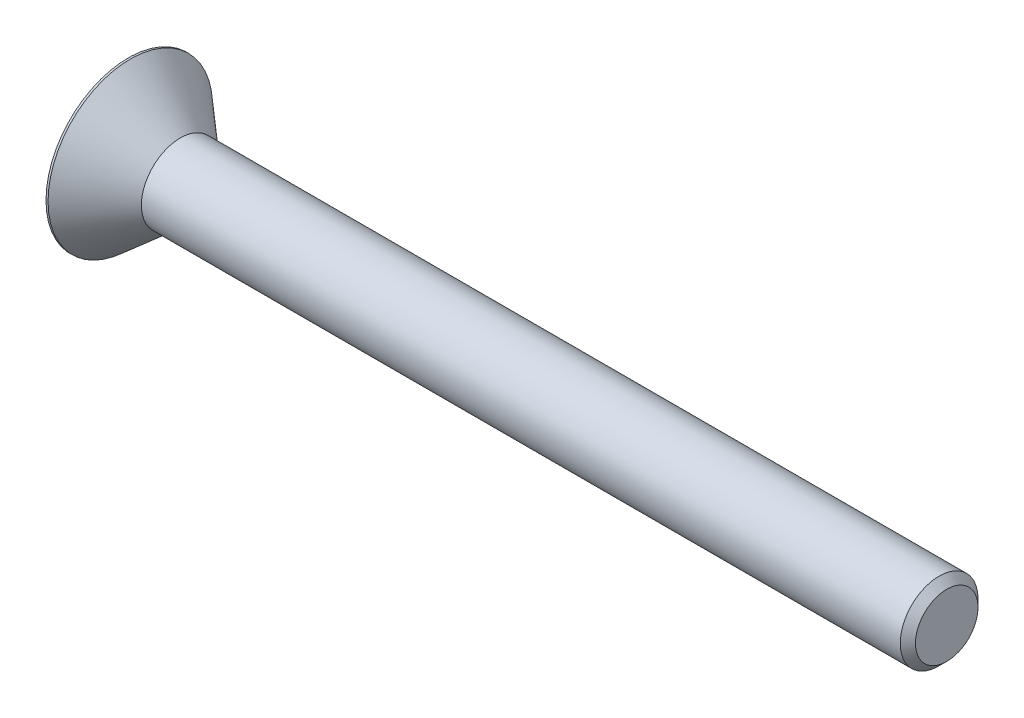
ISO-10303-21;
HEADER;
FILE_DESCRIPTION(('STEP AP214'),'2;1');
FILE_NAME('part.step','',(''),(''),'','','');
FILE_SCHEMA(('AUTOMOTIVE_DESIGN { 1 0 10303 214 1 1 1 1 }'));
ENDSEC;
DATA;
#1=APPLICATION_CONTEXT('core data for automotive mechanical design processes');
#2=APPLICATION_PROTOCOL_DEFINITION('international standard','automotive_design',2000,#1);
#3=PRODUCT_CONTEXT('',#1,'mechanical');
#4=PRODUCT('Part','Part','',(#3));
#5=PRODUCT_RELATED_PRODUCT_CATEGORY('part','',(#4));
#6=PRODUCT_DEFINITION_FORMATION('','',#4);
#7=PRODUCT_DEFINITION_CONTEXT('part definition',#1,'design');
#8=PRODUCT_DEFINITION('design','',#6,#7);
#9=PRODUCT_DEFINITION_SHAPE('','',#8);
#10=(LENGTH_UNIT() NAMED_UNIT(*) SI_UNIT(.MILLI.,.METRE.));
#11=(NAMED_UNIT(*) PLANE_ANGLE_UNIT() SI_UNIT($,.RADIAN.));
#12=(NAMED_UNIT(*) SI_UNIT($,.STERADIAN.) SOLID_ANGLE_UNIT());
#13=UNCERTAINTY_MEASURE_WITH_UNIT(LENGTH_MEASURE(1.E-05),#10,'distance_accuracy_value','');
#14=(GEOMETRIC_REPRESENTATION_CONTEXT(3) GLOBAL_UNCERTAINTY_ASSIGNED_CONTEXT((#13)) GLOBAL_UNIT_ASSIGNED_CONTEXT((#10,
#11,#12)) REPRESENTATION_CONTEXT('',''));
#15=CARTESIAN_POINT('',(0.,0.,0.));
#16=DIRECTION('',(0.,0.,1.));
#17=DIRECTION('',(1.,0.,0.));
#18=AXIS2_PLACEMENT_3D('',#15,#16,#17);
#19=CARTESIAN_POINT('',(2.20980000000282,0.,0.));
#20=DIRECTION('',(-1.,0.,0.));
#21=DIRECTION('',(0.,0.,1.));
#22=AXIS2_PLACEMENT_3D('',#19,#20,#21);
#23=CONICAL_SURFACE('',#22,1.58750000002783,1.04719755117658);
#24=CARTESIAN_POINT('',(3.12634355233854,0.,-5.6843418860808E-11));
#25=VERTEX_POINT('',#24);
#26=VERTEX_LOOP('',#25);
#27=FACE_BOUND('',#26,.T.);
#28=CARTESIAN_POINT('',(2.20980000000282,0.,0.));
#29=DIRECTION('',(-1.,0.,0.));
#30=DIRECTION('',(0.,0.,1.));
#31=AXIS2_PLACEMENT_3D('',#28,#29,#30);
#32=CIRCLE('',#31,1.58750000002783);
#33=CARTESIAN_POINT('',(2.20980000000141,0.,-1.58750000001392));
#34=VERTEX_POINT('',#33);
#35=CARTESIAN_POINT('',(2.20980000000141,1.37481532851985,-0.793750000006957));
#36=VERTEX_POINT('',#35);
#37=EDGE_CURVE('E19',#34,#36,#32,.F.);
#38=ORIENTED_EDGE('',*,*,#37,.F.);
#39=CARTESIAN_POINT('',(2.20980000000282,0.,0.));
#40=DIRECTION('',(-1.,0.,0.));
#41=DIRECTION('',(0.,0.,1.));
#42=AXIS2_PLACEMENT_3D('',#39,#40,#41);
#43=CIRCLE('',#42,1.58750000002783);
#44=CARTESIAN_POINT('',(2.20980000000141,-1.37481532851985,-0.79375000000696));
#45=VERTEX_POINT('',#44);
#46=EDGE_CURVE('E87',#45,#34,#43,.F.);
#47=ORIENTED_EDGE('',*,*,#46,.F.);
#48=CARTESIAN_POINT('',(2.20980000000282,0.,0.));
#49=DIRECTION('',(-1.,0.,0.));
#50=DIRECTION('',(0.,0.,1.));
#51=AXIS2_PLACEMENT_3D('',#48,#49,#50);
#52=CIRCLE('',#51,1.58750000002783);
#53=CARTESIAN_POINT('',(2.20980000000141,-1.37481532851985,0.79375000000696));
#54=VERTEX_POINT('',#53);
#55=EDGE_CURVE('E105',#54,#45,#52,.F.);
#56=ORIENTED_EDGE('',*,*,#55,.F.);
#57=CARTESIAN_POINT('',(2.20980000000282,0.,0.));
#58=DIRECTION('',(-1.,0.,0.));
#59=DIRECTION('',(0.,0.,1.));
#60=AXIS2_PLACEMENT_3D('',#57,#58,#59);
#61=CIRCLE('',#60,1.58750000002783);
#62=CARTESIAN_POINT('',(2.20980000000141,0.,1.58750000001392));
#63=VERTEX_POINT('',#62);
#64=EDGE_CURVE('E104',#63,#54,#61,.F.);
#65=ORIENTED_EDGE('',*,*,#64,.F.);
#66=CARTESIAN_POINT('',(2.20980000000282,0.,0.));
#67=DIRECTION('',(-1.,0.,0.));
#68=DIRECTION('',(0.,0.,1.));
#69=AXIS2_PLACEMENT_3D('',#66,#67,#68);
#70=CIRCLE('',#69,1.58750000002783);
#71=CARTESIAN_POINT('',(2.20980000000141,1.37481532851985,0.793750000006956));
#72=VERTEX_POINT('',#71);
#73=EDGE_CURVE('E167',#72,#63,#70,.F.);
#74=ORIENTED_EDGE('',*,*,#73,.F.);
#75=CARTESIAN_POINT('',(2.20980000000282,0.,0.));
#76=DIRECTION('',(-1.,0.,0.));
#77=DIRECTION('',(0.,0.,1.));
#78=AXIS2_PLACEMENT_3D('',#75,#76,#77);
#79=CIRCLE('',#78,1.58750000002783);
#80=EDGE_CURVE('E90',#36,#72,#79,.F.);
#81=ORIENTED_EDGE('',*,*,#80,.F.);
#82=EDGE_LOOP('',(#38,#47,#56,#65,#74,#81));
#83=FACE_BOUND('',#82,.T.);
#84=ADVANCED_FACE('F16',(#27,#83),#23,.F.);
#85=CARTESIAN_POINT('',(2.2098,-1.83308710467706,0.));
#86=DIRECTION('',(-1.,0.,0.));
#87=DIRECTION('',(0.,0.,1.));
#88=AXIS2_PLACEMENT_3D('',#85,#86,#87);
#89=PLANE('',#88);
#90=DIRECTION('',(0.,-0.500000000000001,0.866025403784438));
#91=VECTOR('',#90,1.);
#92=CARTESIAN_POINT('',(2.2098,-1.83308710467706,0.));
#93=LINE('',#92,#91);
#94=CARTESIAN_POINT('',(2.2098,-1.83308710467706,0.));
#95=VERTEX_POINT('',#94);
#96=EDGE_CURVE('E128',#95,#45,#93,.F.);
#97=ORIENTED_EDGE('',*,*,#96,.F.);
#98=DIRECTION('',(0.,0.500000000000002,0.866025403784438));
#99=VECTOR('',#98,1.);
#100=CARTESIAN_POINT('',(2.2098,-0.916543552338528,1.5875));
#101=LINE('',#100,#99);
#102=EDGE_CURVE('E144',#54,#95,#101,.F.);
#103=ORIENTED_EDGE('',*,*,#102,.F.);
#104=ORIENTED_EDGE('',*,*,#55,.T.);
#105=EDGE_LOOP('',(#97,#103,#104));
#106=FACE_BOUND('',#105,.T.);
#107=ADVANCED_FACE('F263',(#106),#89,.T.);
#108=CARTESIAN_POINT('',(2.2098,-1.83308710467706,0.));
#109=DIRECTION('',(-1.,0.,0.));
#110=DIRECTION('',(0.,0.,1.));
#111=AXIS2_PLACEMENT_3D('',#108,#109,#110);
#112=PLANE('',#111);
#113=DIRECTION('',(0.,1.,0.));
#114=VECTOR('',#113,1.);
#115=CARTESIAN_POINT('',(2.2098,-0.91654355233853,-1.5875));
#116=LINE('',#115,#114);
#117=CARTESIAN_POINT('',(2.2098,-0.91654355233853,-1.5875));
#118=VERTEX_POINT('',#117);
#119=EDGE_CURVE('E100',#118,#34,#116,.T.);
#120=ORIENTED_EDGE('',*,*,#119,.F.);
#121=DIRECTION('',(0.,-0.500000000000001,0.866025403784438));
#122=VECTOR('',#121,1.);
#123=CARTESIAN_POINT('',(2.2098,-1.83308710467706,0.));
#124=LINE('',#123,#122);
#125=EDGE_CURVE('E102',#45,#118,#124,.F.);
#126=ORIENTED_EDGE('',*,*,#125,.F.);
#127=ORIENTED_EDGE('',*,*,#46,.T.);
#128=EDGE_LOOP('',(#120,#126,#127));
#129=FACE_BOUND('',#128,.T.);
#130=ADVANCED_FACE('F98',(#129),#112,.T.);
#131=CARTESIAN_POINT('',(2.2098,-1.83308710467706,0.));
#132=DIRECTION('',(-1.,0.,0.));
#133=DIRECTION('',(0.,0.,1.));
#134=AXIS2_PLACEMENT_3D('',#131,#132,#133);
#135=PLANE('',#134);
#136=DIRECTION('',(0.,-0.5,-0.866025403784439));
#137=VECTOR('',#136,1.);
#138=CARTESIAN_POINT('',(2.2098,0.91654355233853,-1.5875));
#139=LINE('',#138,#137);
#140=CARTESIAN_POINT('',(2.2098,0.91654355233853,-1.5875));
#141=VERTEX_POINT('',#140);
#142=EDGE_CURVE('E109',#141,#36,#139,.F.);
#143=ORIENTED_EDGE('',*,*,#142,.F.);
#144=DIRECTION('',(0.,1.,0.));
#145=VECTOR('',#144,1.);
#146=CARTESIAN_POINT('',(2.2098,-0.91654355233853,-1.5875));
#147=LINE('',#146,#145);
#148=EDGE_CURVE('E107',#34,#141,#147,.T.);
#149=ORIENTED_EDGE('',*,*,#148,.F.);
#150=ORIENTED_EDGE('',*,*,#37,.T.);
#151=EDGE_LOOP('',(#143,#149,#150));
#152=FACE_BOUND('',#151,.T.);
#153=ADVANCED_FACE('F108',(#152),#135,.T.);
#154=CARTESIAN_POINT('',(2.2098,-1.83308710467706,0.));
#155=DIRECTION('',(-1.,0.,0.));
#156=DIRECTION('',(0.,0.,1.));
#157=AXIS2_PLACEMENT_3D('',#154,#155,#156);
#158=PLANE('',#157);
#159=DIRECTION('',(0.,0.499999999999999,-0.866025403784439));
#160=VECTOR('',#159,1.);
#161=CARTESIAN_POINT('',(2.2098,1.83308710467706,0.));
#162=LINE('',#161,#160);
#163=CARTESIAN_POINT('',(2.2098,1.83308710467706,0.));
#164=VERTEX_POINT('',#163);
#165=EDGE_CURVE('E173',#164,#72,#162,.F.);
#166=ORIENTED_EDGE('',*,*,#165,.F.);
#167=DIRECTION('',(0.,-0.5,-0.866025403784439));
#168=VECTOR('',#167,1.);
#169=CARTESIAN_POINT('',(2.2098,0.91654355233853,-1.5875));
#170=LINE('',#169,#168);
#171=EDGE_CURVE('E175',#36,#164,#170,.F.);
#172=ORIENTED_EDGE('',*,*,#171,.F.);
#173=ORIENTED_EDGE('',*,*,#80,.T.);
#174=EDGE_LOOP('',(#166,#172,#173));
#175=FACE_BOUND('',#174,.T.);
#176=ADVANCED_FACE('F172',(#175),#158,.T.);
#177=CARTESIAN_POINT('',(2.2098,-1.83308710467706,0.));
#178=DIRECTION('',(-1.,0.,0.));
#179=DIRECTION('',(0.,0.,1.));
#180=AXIS2_PLACEMENT_3D('',#177,#178,#179);
#181=PLANE('',#180);
#182=DIRECTION('',(0.,1.,0.));
#183=VECTOR('',#182,1.);
#184=CARTESIAN_POINT('',(2.2098,0.91654355233853,1.5875));
#185=LINE('',#184,#183);
#186=CARTESIAN_POINT('',(2.2098,0.91654355233853,1.5875));
#187=VERTEX_POINT('',#186);
#188=EDGE_CURVE('E186',#187,#63,#185,.F.);
#189=ORIENTED_EDGE('',*,*,#188,.F.);
#190=DIRECTION('',(0.,0.499999999999999,-0.866025403784439));
#191=VECTOR('',#190,1.);
#192=CARTESIAN_POINT('',(2.2098,1.83308710467706,0.));
#193=LINE('',#192,#191);
#194=EDGE_CURVE('E178',#72,#187,#193,.F.);
#195=ORIENTED_EDGE('',*,*,#194,.F.);
#196=ORIENTED_EDGE('',*,*,#73,.T.);
#197=EDGE_LOOP('',(#189,#195,#196));
#198=FACE_BOUND('',#197,.T.);
#199=ADVANCED_FACE('F183',(#198),#181,.T.);
#200=CARTESIAN_POINT('',(2.2098,-1.83308710467706,0.));
#201=DIRECTION('',(-1.,0.,0.));
#202=DIRECTION('',(0.,0.,1.));
#203=AXIS2_PLACEMENT_3D('',#200,#201,#202);
#204=PLANE('',#203);
#205=DIRECTION('',(0.,0.500000000000002,0.866025403784438));
#206=VECTOR('',#205,1.);
#207=CARTESIAN_POINT('',(2.2098,-0.916543552338528,1.5875));
#208=LINE('',#207,#206);
#209=CARTESIAN_POINT('',(2.2098,-0.916543552338528,1.5875));
#210=VERTEX_POINT('',#209);
#211=EDGE_CURVE('E148',#210,#54,#208,.F.);
#212=ORIENTED_EDGE('',*,*,#211,.F.);
#213=DIRECTION('',(0.,1.,0.));
#214=VECTOR('',#213,1.);
#215=CARTESIAN_POINT('',(2.2098,0.91654355233853,1.5875));
#216=LINE('',#215,#214);
#217=EDGE_CURVE('E192',#63,#210,#216,.F.);
#218=ORIENTED_EDGE('',*,*,#217,.F.);
#219=ORIENTED_EDGE('',*,*,#64,.T.);
#220=EDGE_LOOP('',(#212,#218,#219));
#221=FACE_BOUND('',#220,.T.);
#222=ADVANCED_FACE('F193',(#221),#204,.T.);
#223=CARTESIAN_POINT('',(2.2098,-0.916543552338528,1.5875));
#224=DIRECTION('',(0.,0.866025403784438,-0.500000000000002));
#225=DIRECTION('',(0.,0.500000000000002,0.866025403784438));
#226=AXIS2_PLACEMENT_3D('',#223,#224,#225);
#227=PLANE('',#226);
#228=ORIENTED_EDGE('',*,*,#102,.T.);
#229=DIRECTION('',(1.,0.,0.));
#230=VECTOR('',#229,1.);
#231=CARTESIAN_POINT('',(2.2098,-1.83308710467706,0.));
#232=LINE('',#231,#230);
#233=CARTESIAN_POINT('',(0.,-1.83308710467706,0.));
#234=VERTEX_POINT('',#233);
#235=EDGE_CURVE('E139',#234,#95,#232,.T.);
#236=ORIENTED_EDGE('',*,*,#235,.F.);
#237=DIRECTION('',(0.,-0.500000000000002,-0.866025403784438));
#238=VECTOR('',#237,1.);
#239=CARTESIAN_POINT('',(0.,-0.916543552338528,1.5875));
#240=LINE('',#239,#238);
#241=CARTESIAN_POINT('',(0.,-0.916543552338528,1.5875));
#242=VERTEX_POINT('',#241);
#243=EDGE_CURVE('E135',#242,#234,#240,.T.);
#244=ORIENTED_EDGE('',*,*,#243,.F.);
#245=DIRECTION('',(1.,0.,0.));
#246=VECTOR('',#245,1.);
#247=CARTESIAN_POINT('',(2.2098,-0.916543552338528,1.5875));
#248=LINE('',#247,#246);
#249=EDGE_CURVE('E153',#210,#242,#248,.F.);
#250=ORIENTED_EDGE('',*,*,#249,.F.);
#251=ORIENTED_EDGE('',*,*,#211,.T.);
#252=EDGE_LOOP('',(#228,#236,#244,#250,#251));
#253=FACE_BOUND('',#252,.T.);
#254=ADVANCED_FACE('F258',(#253),#227,.T.);
#255=CARTESIAN_POINT('',(2.2098,-1.83308710467706,0.));
#256=DIRECTION('',(0.,0.866025403784438,0.500000000000001));
#257=DIRECTION('',(0.,-0.500000000000001,0.866025403784438));
#258=AXIS2_PLACEMENT_3D('',#255,#256,#257);
#259=PLANE('',#258);
#260=ORIENTED_EDGE('',*,*,#125,.T.);
#261=DIRECTION('',(1.,0.,0.));
#262=VECTOR('',#261,1.);
#263=CARTESIAN_POINT('',(2.2098,-0.91654355233853,-1.5875));
#264=LINE('',#263,#262);
#265=CARTESIAN_POINT('',(0.,-0.91654355233853,-1.5875));
#266=VERTEX_POINT('',#265);
#267=EDGE_CURVE('E116',#266,#118,#264,.T.);
#268=ORIENTED_EDGE('',*,*,#267,.F.);
#269=DIRECTION('',(0.,0.500000000000001,-0.866025403784438));
#270=VECTOR('',#269,1.);
#271=CARTESIAN_POINT('',(0.,-1.83308710467706,0.));
#272=LINE('',#271,#270);
#273=EDGE_CURVE('E131',#234,#266,#272,.T.);
#274=ORIENTED_EDGE('',*,*,#273,.F.);
#275=ORIENTED_EDGE('',*,*,#235,.T.);
#276=ORIENTED_EDGE('',*,*,#96,.T.);
#277=EDGE_LOOP('',(#260,#268,#274,#275,#276));
#278=FACE_BOUND('',#277,.T.);
#279=ADVANCED_FACE('F261',(#278),#259,.T.);
#280=CARTESIAN_POINT('',(2.2098,-0.91654355233853,-1.5875));
#281=DIRECTION('',(0.,0.,1.));
#282=DIRECTION('',(1.,0.,0.));
#283=AXIS2_PLACEMENT_3D('',#280,#281,#282);
#284=PLANE('',#283);
#285=ORIENTED_EDGE('',*,*,#148,.T.);
#286=DIRECTION('',(1.,0.,0.));
#287=VECTOR('',#286,1.);
#288=CARTESIAN_POINT('',(2.2098,0.91654355233853,-1.5875));
#289=LINE('',#288,#287);
#290=CARTESIAN_POINT('',(0.,0.91654355233853,-1.5875));
#291=VERTEX_POINT('',#290);
#292=EDGE_CURVE('E112',#291,#141,#289,.T.);
#293=ORIENTED_EDGE('',*,*,#292,.F.);
#294=DIRECTION('',(0.,1.,0.));
#295=VECTOR('',#294,1.);
#296=CARTESIAN_POINT('',(0.,0.,-1.5875));
#297=LINE('',#296,#295);
#298=EDGE_CURVE('E134',#266,#291,#297,.T.);
#299=ORIENTED_EDGE('',*,*,#298,.F.);
#300=ORIENTED_EDGE('',*,*,#267,.T.);
#301=ORIENTED_EDGE('',*,*,#119,.T.);
#302=EDGE_LOOP('',(#285,#293,#299,#300,#301));
#303=FACE_BOUND('',#302,.T.);
#304=ADVANCED_FACE('F114',(#303),#284,.T.);
#305=CARTESIAN_POINT('',(2.2098,0.91654355233853,-1.5875));
#306=DIRECTION('',(0.,-0.866025403784439,0.5));
#307=DIRECTION('',(0.,-0.5,-0.866025403784439));
#308=AXIS2_PLACEMENT_3D('',#305,#306,#307);
#309=PLANE('',#308);
#310=ORIENTED_EDGE('',*,*,#171,.T.);
#311=DIRECTION('',(1.,0.,0.));
#312=VECTOR('',#311,1.);
#313=CARTESIAN_POINT('',(2.2098,1.83308710467706,0.));
#314=LINE('',#313,#312);
#315=CARTESIAN_POINT('',(0.,1.83308710467706,0.));
#316=VERTEX_POINT('',#315);
#317=EDGE_CURVE('E180',#316,#164,#314,.T.);
#318=ORIENTED_EDGE('',*,*,#317,.F.);
#319=DIRECTION('',(0.,0.5,0.866025403784439));
#320=VECTOR('',#319,1.);
#321=CARTESIAN_POINT('',(0.,0.91654355233853,-1.5875));
#322=LINE('',#321,#320);
#323=EDGE_CURVE('E226',#291,#316,#322,.T.);
#324=ORIENTED_EDGE('',*,*,#323,.F.);
#325=ORIENTED_EDGE('',*,*,#292,.T.);
#326=ORIENTED_EDGE('',*,*,#142,.T.);
#327=EDGE_LOOP('',(#310,#318,#324,#325,#326));
#328=FACE_BOUND('',#327,.T.);
#329=ADVANCED_FACE('F255',(#328),#309,.T.);
#330=CARTESIAN_POINT('',(2.2098,1.83308710467706,0.));
#331=DIRECTION('',(0.,-0.866025403784439,-0.499999999999999));
#332=DIRECTION('',(0.,0.499999999999999,-0.866025403784439));
#333=AXIS2_PLACEMENT_3D('',#330,#331,#332);
#334=PLANE('',#333);
#335=ORIENTED_EDGE('',*,*,#194,.T.);
#336=DIRECTION('',(1.,0.,0.));
#337=VECTOR('',#336,1.);
#338=CARTESIAN_POINT('',(2.2098,0.91654355233853,1.5875));
#339=LINE('',#338,#337);
#340=CARTESIAN_POINT('',(0.,0.91654355233853,1.5875));
#341=VERTEX_POINT('',#340);
#342=EDGE_CURVE('E34',#341,#187,#339,.T.);
#343=ORIENTED_EDGE('',*,*,#342,.F.);
#344=DIRECTION('',(0.,-0.499999999999999,0.866025403784439));
#345=VECTOR('',#344,1.);
#346=CARTESIAN_POINT('',(0.,1.83308710467706,0.));
#347=LINE('',#346,#345);
#348=EDGE_CURVE('E221',#316,#341,#347,.T.);
#349=ORIENTED_EDGE('',*,*,#348,.F.);
#350=ORIENTED_EDGE('',*,*,#317,.T.);
#351=ORIENTED_EDGE('',*,*,#165,.T.);
#352=EDGE_LOOP('',(#335,#343,#349,#350,#351));
#353=FACE_BOUND('',#352,.T.);
#354=ADVANCED_FACE('F177',(#353),#334,.T.);
#355=CARTESIAN_POINT('',(2.2098,0.91654355233853,1.5875));
#356=DIRECTION('',(0.,0.,-1.));
#357=DIRECTION('',(0.,1.,0.));
#358=AXIS2_PLACEMENT_3D('',#355,#356,#357);
#359=PLANE('',#358);
#360=ORIENTED_EDGE('',*,*,#217,.T.);
#361=ORIENTED_EDGE('',*,*,#249,.T.);
#362=DIRECTION('',(0.,1.,0.));
#363=VECTOR('',#362,1.);
#364=CARTESIAN_POINT('',(0.,0.,1.5875));
#365=LINE('',#364,#363);
#366=EDGE_CURVE('E163',#341,#242,#365,.F.);
#367=ORIENTED_EDGE('',*,*,#366,.F.);
#368=ORIENTED_EDGE('',*,*,#342,.T.);
#369=ORIENTED_EDGE('',*,*,#188,.T.);
#370=EDGE_LOOP('',(#360,#361,#367,#368,#369));
#371=FACE_BOUND('',#370,.T.);
#372=ADVANCED_FACE('F199',(#371),#359,.T.);
#373=CARTESIAN_POINT('',(0.,0.,0.));
#374=DIRECTION('',(-1.,0.,0.));
#375=DIRECTION('',(0.,0.,1.));
#376=AXIS2_PLACEMENT_3D('',#373,#374,#375);
#377=PLANE('',#376);
#378=ORIENTED_EDGE('',*,*,#348,.T.);
#379=ORIENTED_EDGE('',*,*,#366,.T.);
#380=ORIENTED_EDGE('',*,*,#243,.T.);
#381=ORIENTED_EDGE('',*,*,#273,.T.);
#382=ORIENTED_EDGE('',*,*,#298,.T.);
#383=ORIENTED_EDGE('',*,*,#323,.T.);
#384=EDGE_LOOP('',(#378,#379,#380,#381,#382,#383));
#385=FACE_BOUND('',#384,.T.);
#386=CARTESIAN_POINT('',(0.,0.,0.));
#387=DIRECTION('',(-1.,0.,0.));
#388=DIRECTION('',(0.,0.,1.));
#389=AXIS2_PLACEMENT_3D('',#386,#387,#388);
#390=CIRCLE('',#389,5.10667);
#391=CARTESIAN_POINT('',(0.,0.,5.10667));
#392=VERTEX_POINT('',#391);
#393=EDGE_CURVE('E160',#392,#392,#390,.F.);
#394=ORIENTED_EDGE('',*,*,#393,.F.);
#395=EDGE_LOOP('',(#394));
#396=FACE_BOUND('',#395,.T.);
#397=ADVANCED_FACE('F250',(#385,#396),#377,.T.);
#398=CARTESIAN_POINT('',(50.8,1.94056,0.));
#399=DIRECTION('',(1.,0.,0.));
#400=DIRECTION('',(0.,0.,-1.));
#401=AXIS2_PLACEMENT_3D('',#398,#399,#400);
#402=PLANE('',#401);
#403=CARTESIAN_POINT('',(50.7999999999811,0.,0.));
#404=DIRECTION('',(-1.,0.,0.));
#405=DIRECTION('',(0.,0.,1.));
#406=AXIS2_PLACEMENT_3D('',#403,#404,#405);
#407=CIRCLE('',#406,1.94055999998);
#408=CARTESIAN_POINT('',(50.7999999999811,0.,1.94055999998));
#409=VERTEX_POINT('',#408);
#410=EDGE_CURVE('E156',#409,#409,#407,.T.);
#411=ORIENTED_EDGE('',*,*,#410,.F.);
#412=EDGE_LOOP('',(#411));
#413=FACE_BOUND('',#412,.T.);
#414=ADVANCED_FACE('F292',(#413),#402,.T.);
#415=CARTESIAN_POINT('',(0.,0.,0.));
#416=DIRECTION('',(-1.,0.,0.));
#417=DIRECTION('',(0.,0.,1.));
#418=AXIS2_PLACEMENT_3D('',#415,#416,#417);
#419=CYLINDRICAL_SURFACE('',#418,5.10667);
#420=ORIENTED_EDGE('',*,*,#393,.T.);
#421=EDGE_LOOP('',(#420));
#422=FACE_BOUND('',#421,.T.);
#423=CARTESIAN_POINT('',(0.127000000020416,0.,0.));
#424=DIRECTION('',(-1.,0.,0.));
#425=DIRECTION('',(0.,0.,1.));
#426=AXIS2_PLACEMENT_3D('',#423,#424,#425);
#427=CIRCLE('',#426,5.10666999997511);
#428=CARTESIAN_POINT('',(0.127000000020416,0.,5.10666999997511));
#429=VERTEX_POINT('',#428);
#430=EDGE_CURVE('E159',#429,#429,#427,.F.);
#431=ORIENTED_EDGE('',*,*,#430,.F.);
#432=EDGE_LOOP('',(#431));
#433=FACE_BOUND('',#432,.T.);
#434=ADVANCED_FACE('F288',(#422,#433),#419,.T.);
#435=CARTESIAN_POINT('',(50.3275600000279,0.,0.));
#436=DIRECTION('',(-1.,0.,0.));
#437=DIRECTION('',(0.,0.,1.));
#438=AXIS2_PLACEMENT_3D('',#435,#436,#437);
#439=CONICAL_SURFACE('',#438,2.41299999993316,0.785398163397448);
#440=CARTESIAN_POINT('',(50.32756,0.,0.));
#441=DIRECTION('',(-1.,0.,0.));
#442=DIRECTION('',(0.,0.,1.));
#443=AXIS2_PLACEMENT_3D('',#440,#441,#442);
#444=CIRCLE('',#443,2.41299999999999);
#445=CARTESIAN_POINT('',(50.32756,0.,2.41299999999999));
#446=VERTEX_POINT('',#445);
#447=EDGE_CURVE('E25',#446,#446,#444,.T.);
#448=ORIENTED_EDGE('',*,*,#447,.F.);
#449=EDGE_LOOP('',(#448));
#450=FACE_BOUND('',#449,.T.);
#451=ORIENTED_EDGE('',*,*,#410,.T.);
#452=EDGE_LOOP('',(#451));
#453=FACE_BOUND('',#452,.T.);
#454=ADVANCED_FACE('F281',(#450,#453),#439,.T.);
#455=CARTESIAN_POINT('',(0.127000000020416,0.,0.));
#456=DIRECTION('',(-1.,0.,0.));
#457=DIRECTION('',(0.,0.,1.));
#458=AXIS2_PLACEMENT_3D('',#455,#456,#457);
#459=CONICAL_SURFACE('',#458,5.10666999997511,0.715584993312814);
#460=ORIENTED_EDGE('',*,*,#430,.T.);
#461=EDGE_LOOP('',(#460));
#462=FACE_BOUND('',#461,.T.);
#463=CARTESIAN_POINT('',(3.22571286747901,0.,0.));
#464=DIRECTION('',(-1.,0.,0.));
#465=DIRECTION('',(0.,0.,1.));
#466=AXIS2_PLACEMENT_3D('',#463,#464,#465);
#467=CIRCLE('',#466,2.41299999999999);
#468=CARTESIAN_POINT('',(3.22571286747901,0.,2.41299999999999));
#469=VERTEX_POINT('',#468);
#470=EDGE_CURVE('E11',#469,#469,#467,.F.);
#471=ORIENTED_EDGE('',*,*,#470,.F.);
#472=EDGE_LOOP('',(#471));
#473=FACE_BOUND('',#472,.T.);
#474=ADVANCED_FACE('F275',(#462,#473),#459,.T.);
#475=CARTESIAN_POINT('',(0.,0.,0.));
#476=DIRECTION('',(-1.,0.,0.));
#477=DIRECTION('',(0.,0.,1.));
#478=AXIS2_PLACEMENT_3D('',#475,#476,#477);
#479=CYLINDRICAL_SURFACE('',#478,2.41299999999999);
#480=ORIENTED_EDGE('',*,*,#470,.T.);
#481=EDGE_LOOP('',(#480));
#482=FACE_BOUND('',#481,.T.);
#483=ORIENTED_EDGE('',*,*,#447,.T.);
#484=EDGE_LOOP('',(#483));
#485=FACE_BOUND('',#484,.T.);
#486=ADVANCED_FACE('F273',(#482,#485),#479,.T.);
#487=CLOSED_SHELL('',(#84,#107,#130,#153,#176,#199,#222,#254,#279,#304,#329,#354,#372,#397,#414,
#434,#454,#474,#486));
#488=MANIFOLD_SOLID_BREP('B1',#487);
#489=ADVANCED_BREP_SHAPE_REPRESENTATION('',(#18,#488),#14);
#490=SHAPE_DEFINITION_REPRESENTATION(#9,#489);
ENDSEC;
END-ISO-10303-21;
